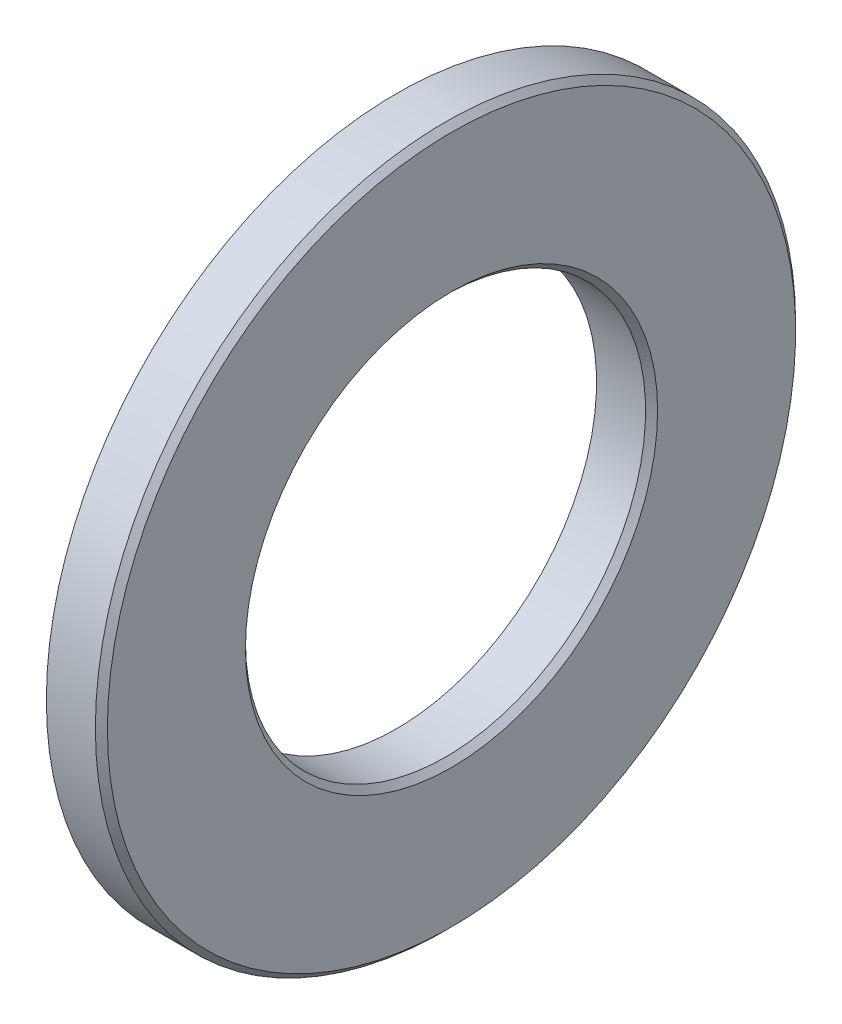
ISO-10303-21;
HEADER;
FILE_DESCRIPTION(('STEP AP214'),'2;1');
FILE_NAME('part.step','',(''),(''),'','','');
FILE_SCHEMA(('AUTOMOTIVE_DESIGN { 1 0 10303 214 1 1 1 1 }'));
ENDSEC;
DATA;
#1=APPLICATION_CONTEXT('core data for automotive mechanical design processes');
#2=APPLICATION_PROTOCOL_DEFINITION('international standard','automotive_design',2000,#1);
#3=PRODUCT_CONTEXT('',#1,'mechanical');
#4=PRODUCT('Part','Part','',(#3));
#5=PRODUCT_RELATED_PRODUCT_CATEGORY('part','',(#4));
#6=PRODUCT_DEFINITION_FORMATION('','',#4);
#7=PRODUCT_DEFINITION_CONTEXT('part definition',#1,'design');
#8=PRODUCT_DEFINITION('design','',#6,#7);
#9=PRODUCT_DEFINITION_SHAPE('','',#8);
#10=(LENGTH_UNIT() NAMED_UNIT(*) SI_UNIT(.MILLI.,.METRE.));
#11=(NAMED_UNIT(*) PLANE_ANGLE_UNIT() SI_UNIT($,.RADIAN.));
#12=(NAMED_UNIT(*) SI_UNIT($,.STERADIAN.) SOLID_ANGLE_UNIT());
#13=UNCERTAINTY_MEASURE_WITH_UNIT(LENGTH_MEASURE(1.E-05),#10,'distance_accuracy_value','');
#14=(GEOMETRIC_REPRESENTATION_CONTEXT(3) GLOBAL_UNCERTAINTY_ASSIGNED_CONTEXT((#13)) GLOBAL_UNIT_ASSIGNED_CONTEXT((#10,
#11,#12)) REPRESENTATION_CONTEXT('',''));
#15=CARTESIAN_POINT('',(0.,0.,0.));
#16=DIRECTION('',(0.,0.,1.));
#17=DIRECTION('',(1.,0.,0.));
#18=AXIS2_PLACEMENT_3D('',#15,#16,#17);
#19=CARTESIAN_POINT('',(1.,17.5,0.));
#20=DIRECTION('',(1.,0.,0.));
#21=DIRECTION('',(0.,0.,-1.));
#22=AXIS2_PLACEMENT_3D('',#19,#20,#21);
#23=PLANE('',#22);
#24=CARTESIAN_POINT('',(1.,0.,0.));
#25=DIRECTION('',(-1.,0.,0.));
#26=DIRECTION('',(0.,0.,1.));
#27=AXIS2_PLACEMENT_3D('',#24,#25,#26);
#28=CIRCLE('',#27,10.);
#29=CARTESIAN_POINT('',(1.,0.,10.));
#30=VERTEX_POINT('',#29);
#31=EDGE_CURVE('E10',#30,#30,#28,.T.);
#32=ORIENTED_EDGE('',*,*,#31,.F.);
#33=EDGE_LOOP('',(#32));
#34=FACE_BOUND('',#33,.T.);
#35=CARTESIAN_POINT('',(1.,0.,0.));
#36=DIRECTION('',(-1.,0.,0.));
#37=DIRECTION('',(0.,0.,1.));
#38=AXIS2_PLACEMENT_3D('',#35,#36,#37);
#39=CIRCLE('',#38,17.5);
#40=CARTESIAN_POINT('',(1.,0.,17.5));
#41=VERTEX_POINT('',#40);
#42=EDGE_CURVE('E51',#41,#41,#39,.T.);
#43=ORIENTED_EDGE('',*,*,#42,.T.);
#44=EDGE_LOOP('',(#43));
#45=FACE_BOUND('',#44,.T.);
#46=ADVANCED_FACE('F29',(#34,#45),#23,.F.);
#47=CARTESIAN_POINT('',(50.,0.,0.));
#48=DIRECTION('',(-1.,0.,0.));
#49=DIRECTION('',(0.,0.,1.));
#50=AXIS2_PLACEMENT_3D('',#47,#48,#49);
#51=CYLINDRICAL_SURFACE('',#50,10.);
#52=CARTESIAN_POINT('',(3.45,0.,0.));
#53=DIRECTION('',(-1.,0.,0.));
#54=DIRECTION('',(0.,0.,1.));
#55=AXIS2_PLACEMENT_3D('',#52,#53,#54);
#56=CIRCLE('',#55,10.);
#57=CARTESIAN_POINT('',(3.45,0.,10.));
#58=VERTEX_POINT('',#57);
#59=EDGE_CURVE('E35',#58,#58,#56,.T.);
#60=ORIENTED_EDGE('',*,*,#59,.F.);
#61=EDGE_LOOP('',(#60));
#62=FACE_BOUND('',#61,.T.);
#63=ORIENTED_EDGE('',*,*,#31,.T.);
#64=EDGE_LOOP('',(#63));
#65=FACE_BOUND('',#64,.T.);
#66=ADVANCED_FACE('F76',(#62,#65),#51,.F.);
#67=CARTESIAN_POINT('',(3.45,0.,0.));
#68=DIRECTION('',(1.,0.,0.));
#69=DIRECTION('',(0.,0.,-1.));
#70=AXIS2_PLACEMENT_3D('',#67,#68,#69);
#71=CONICAL_SURFACE('',#70,10.,0.785398163397445);
#72=CARTESIAN_POINT('',(3.75,0.,0.));
#73=DIRECTION('',(-1.,0.,0.));
#74=DIRECTION('',(0.,0.,1.));
#75=AXIS2_PLACEMENT_3D('',#72,#73,#74);
#76=CIRCLE('',#75,10.3);
#77=CARTESIAN_POINT('',(3.75,0.,10.3));
#78=VERTEX_POINT('',#77);
#79=EDGE_CURVE('E39',#78,#78,#76,.T.);
#80=ORIENTED_EDGE('',*,*,#79,.F.);
#81=EDGE_LOOP('',(#80));
#82=FACE_BOUND('',#81,.T.);
#83=ORIENTED_EDGE('',*,*,#59,.T.);
#84=EDGE_LOOP('',(#83));
#85=FACE_BOUND('',#84,.T.);
#86=ADVANCED_FACE('F71',(#82,#85),#71,.F.);
#87=CARTESIAN_POINT('',(3.75,10.3,0.));
#88=DIRECTION('',(-1.,0.,0.));
#89=DIRECTION('',(0.,0.,1.));
#90=AXIS2_PLACEMENT_3D('',#87,#88,#89);
#91=PLANE('',#90);
#92=CARTESIAN_POINT('',(3.75,0.,0.));
#93=DIRECTION('',(-1.,0.,0.));
#94=DIRECTION('',(0.,0.,1.));
#95=AXIS2_PLACEMENT_3D('',#92,#93,#94);
#96=CIRCLE('',#95,17.2);
#97=CARTESIAN_POINT('',(3.75,0.,17.2));
#98=VERTEX_POINT('',#97);
#99=EDGE_CURVE('E43',#98,#98,#96,.T.);
#100=ORIENTED_EDGE('',*,*,#99,.F.);
#101=EDGE_LOOP('',(#100));
#102=FACE_BOUND('',#101,.T.);
#103=ORIENTED_EDGE('',*,*,#79,.T.);
#104=EDGE_LOOP('',(#103));
#105=FACE_BOUND('',#104,.T.);
#106=ADVANCED_FACE('F65',(#102,#105),#91,.F.);
#107=CARTESIAN_POINT('',(3.75,0.,0.));
#108=DIRECTION('',(-1.,0.,0.));
#109=DIRECTION('',(0.,0.,1.));
#110=AXIS2_PLACEMENT_3D('',#107,#108,#109);
#111=CONICAL_SURFACE('',#110,17.2,0.785398163397448);
#112=CARTESIAN_POINT('',(3.45,0.,0.));
#113=DIRECTION('',(-1.,0.,0.));
#114=DIRECTION('',(0.,0.,1.));
#115=AXIS2_PLACEMENT_3D('',#112,#113,#114);
#116=CIRCLE('',#115,17.5);
#117=CARTESIAN_POINT('',(3.45,0.,17.5));
#118=VERTEX_POINT('',#117);
#119=EDGE_CURVE('E48',#118,#118,#116,.T.);
#120=ORIENTED_EDGE('',*,*,#119,.F.);
#121=EDGE_LOOP('',(#120));
#122=FACE_BOUND('',#121,.T.);
#123=ORIENTED_EDGE('',*,*,#99,.T.);
#124=EDGE_LOOP('',(#123));
#125=FACE_BOUND('',#124,.T.);
#126=ADVANCED_FACE('F59',(#122,#125),#111,.T.);
#127=CARTESIAN_POINT('',(50.,0.,0.));
#128=DIRECTION('',(-1.,0.,0.));
#129=DIRECTION('',(0.,0.,1.));
#130=AXIS2_PLACEMENT_3D('',#127,#128,#129);
#131=CYLINDRICAL_SURFACE('',#130,17.5);
#132=ORIENTED_EDGE('',*,*,#42,.F.);
#133=EDGE_LOOP('',(#132));
#134=FACE_BOUND('',#133,.T.);
#135=ORIENTED_EDGE('',*,*,#119,.T.);
#136=EDGE_LOOP('',(#135));
#137=FACE_BOUND('',#136,.T.);
#138=ADVANCED_FACE('F56',(#134,#137),#131,.T.);
#139=CLOSED_SHELL('',(#46,#66,#86,#106,#126,#138));
#140=MANIFOLD_SOLID_BREP('B2',#139);
#141=ADVANCED_BREP_SHAPE_REPRESENTATION('',(#18,#140),#14);
#142=SHAPE_DEFINITION_REPRESENTATION(#9,#141);
ENDSEC;
END-ISO-10303-21;
